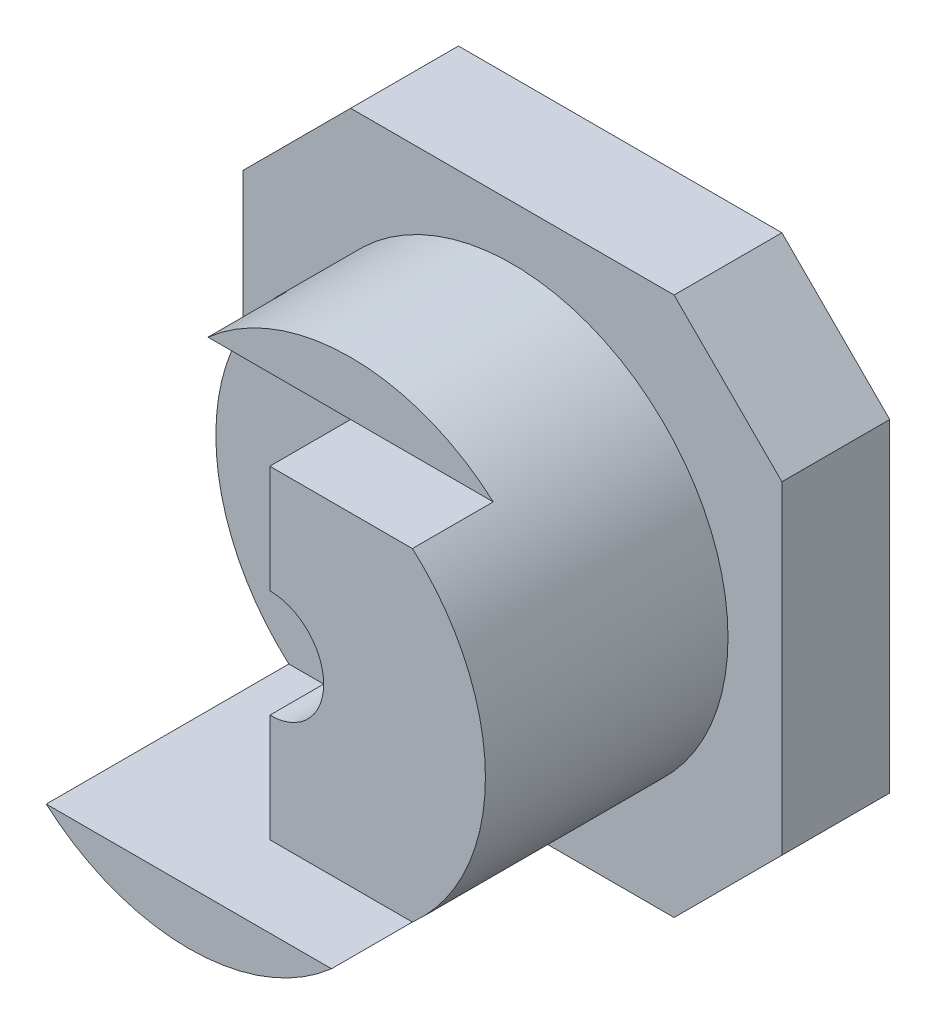
ISO-10303-21;
HEADER;
FILE_DESCRIPTION(('STEP AP214'),'2;1');
FILE_NAME('part.step','',(''),(''),'','','');
FILE_SCHEMA(('AUTOMOTIVE_DESIGN { 1 0 10303 214 1 1 1 1 }'));
ENDSEC;
DATA;
#1=APPLICATION_CONTEXT('core data for automotive mechanical design processes');
#2=APPLICATION_PROTOCOL_DEFINITION('international standard','automotive_design',2000,#1);
#3=PRODUCT_CONTEXT('',#1,'mechanical');
#4=PRODUCT('Part','Part','',(#3));
#5=PRODUCT_RELATED_PRODUCT_CATEGORY('part','',(#4));
#6=PRODUCT_DEFINITION_FORMATION('','',#4);
#7=PRODUCT_DEFINITION_CONTEXT('part definition',#1,'design');
#8=PRODUCT_DEFINITION('design','',#6,#7);
#9=PRODUCT_DEFINITION_SHAPE('','',#8);
#10=(LENGTH_UNIT() NAMED_UNIT(*) SI_UNIT(.MILLI.,.METRE.));
#11=(NAMED_UNIT(*) PLANE_ANGLE_UNIT() SI_UNIT($,.RADIAN.));
#12=(NAMED_UNIT(*) SI_UNIT($,.STERADIAN.) SOLID_ANGLE_UNIT());
#13=UNCERTAINTY_MEASURE_WITH_UNIT(LENGTH_MEASURE(1.E-05),#10,'distance_accuracy_value','');
#14=(GEOMETRIC_REPRESENTATION_CONTEXT(3) GLOBAL_UNCERTAINTY_ASSIGNED_CONTEXT((#13)) GLOBAL_UNIT_ASSIGNED_CONTEXT((#10,
#11,#12)) REPRESENTATION_CONTEXT('',''));
#15=CARTESIAN_POINT('',(0.,0.,0.));
#16=DIRECTION('',(0.,0.,1.));
#17=DIRECTION('',(1.,0.,0.));
#18=AXIS2_PLACEMENT_3D('',#15,#16,#17);
#19=CARTESIAN_POINT('',(0.,0.,2.));
#20=DIRECTION('',(0.,0.,-1.));
#21=DIRECTION('',(-1.,0.,0.));
#22=AXIS2_PLACEMENT_3D('',#19,#20,#21);
#23=PLANE('',#22);
#24=CARTESIAN_POINT('',(0.,0.,2.));
#25=DIRECTION('',(0.,0.,1.));
#26=DIRECTION('',(-1.,0.,0.));
#27=AXIS2_PLACEMENT_3D('',#24,#25,#26);
#28=CIRCLE('',#27,4.);
#29=CARTESIAN_POINT('',(-4.,0.,2.));
#30=VERTEX_POINT('',#29);
#31=EDGE_CURVE('E172',#30,#30,#28,.T.);
#32=ORIENTED_EDGE('',*,*,#31,.F.);
#33=EDGE_LOOP('',(#32));
#34=FACE_BOUND('',#33,.T.);
#35=DIRECTION('',(0.,-1.,0.));
#36=VECTOR('',#35,1.);
#37=CARTESIAN_POINT('',(-5.,-3.,2.));
#38=LINE('',#37,#36);
#39=CARTESIAN_POINT('',(-5.,3.,2.));
#40=VERTEX_POINT('',#39);
#41=CARTESIAN_POINT('',(-5.,-3.,2.));
#42=VERTEX_POINT('',#41);
#43=EDGE_CURVE('E157',#40,#42,#38,.T.);
#44=ORIENTED_EDGE('',*,*,#43,.T.);
#45=DIRECTION('',(0.707106781186548,-0.707106781186548,0.));
#46=VECTOR('',#45,1.);
#47=CARTESIAN_POINT('',(-5.,-3.,2.));
#48=LINE('',#47,#46);
#49=CARTESIAN_POINT('',(-3.,-5.,2.));
#50=VERTEX_POINT('',#49);
#51=EDGE_CURVE('E99',#42,#50,#48,.T.);
#52=ORIENTED_EDGE('',*,*,#51,.T.);
#53=DIRECTION('',(1.,0.,0.));
#54=VECTOR('',#53,1.);
#55=CARTESIAN_POINT('',(-3.,-5.,2.));
#56=LINE('',#55,#54);
#57=CARTESIAN_POINT('',(3.,-5.,2.));
#58=VERTEX_POINT('',#57);
#59=EDGE_CURVE('E253',#50,#58,#56,.T.);
#60=ORIENTED_EDGE('',*,*,#59,.T.);
#61=DIRECTION('',(0.707106781186548,0.707106781186548,0.));
#62=VECTOR('',#61,1.);
#63=CARTESIAN_POINT('',(3.,-5.,2.));
#64=LINE('',#63,#62);
#65=CARTESIAN_POINT('',(5.,-3.,2.));
#66=VERTEX_POINT('',#65);
#67=EDGE_CURVE('E255',#58,#66,#64,.T.);
#68=ORIENTED_EDGE('',*,*,#67,.T.);
#69=DIRECTION('',(0.,1.,0.));
#70=VECTOR('',#69,1.);
#71=CARTESIAN_POINT('',(5.,-3.,2.));
#72=LINE('',#71,#70);
#73=CARTESIAN_POINT('',(5.,3.,2.));
#74=VERTEX_POINT('',#73);
#75=EDGE_CURVE('E120',#66,#74,#72,.T.);
#76=ORIENTED_EDGE('',*,*,#75,.T.);
#77=DIRECTION('',(-0.707106781186548,0.707106781186548,0.));
#78=VECTOR('',#77,1.);
#79=CARTESIAN_POINT('',(3.,5.,2.));
#80=LINE('',#79,#78);
#81=CARTESIAN_POINT('',(3.,5.,2.));
#82=VERTEX_POINT('',#81);
#83=EDGE_CURVE('E114',#74,#82,#80,.T.);
#84=ORIENTED_EDGE('',*,*,#83,.T.);
#85=DIRECTION('',(-1.,0.,0.));
#86=VECTOR('',#85,1.);
#87=CARTESIAN_POINT('',(-3.,5.,2.));
#88=LINE('',#87,#86);
#89=CARTESIAN_POINT('',(-3.,5.,2.));
#90=VERTEX_POINT('',#89);
#91=EDGE_CURVE('E117',#82,#90,#88,.T.);
#92=ORIENTED_EDGE('',*,*,#91,.T.);
#93=DIRECTION('',(-0.707106781186548,-0.707106781186548,0.));
#94=VECTOR('',#93,1.);
#95=CARTESIAN_POINT('',(-5.,3.,2.));
#96=LINE('',#95,#94);
#97=EDGE_CURVE('E57',#90,#40,#96,.T.);
#98=ORIENTED_EDGE('',*,*,#97,.T.);
#99=EDGE_LOOP('',(#44,#52,#60,#68,#76,#84,#92,#98));
#100=FACE_BOUND('',#99,.T.);
#101=ADVANCED_FACE('F33',(#34,#100),#23,.F.);
#102=CARTESIAN_POINT('',(0.,0.,0.));
#103=DIRECTION('',(0.,0.,-1.));
#104=DIRECTION('',(-1.,0.,0.));
#105=AXIS2_PLACEMENT_3D('',#102,#103,#104);
#106=PLANE('',#105);
#107=DIRECTION('',(0.,-1.,0.));
#108=VECTOR('',#107,1.);
#109=CARTESIAN_POINT('',(-5.,-3.,0.));
#110=LINE('',#109,#108);
#111=CARTESIAN_POINT('',(-5.,3.,0.));
#112=VERTEX_POINT('',#111);
#113=CARTESIAN_POINT('',(-5.,-3.,0.));
#114=VERTEX_POINT('',#113);
#115=EDGE_CURVE('E141',#112,#114,#110,.T.);
#116=ORIENTED_EDGE('',*,*,#115,.F.);
#117=DIRECTION('',(-0.707106781186548,-0.707106781186548,0.));
#118=VECTOR('',#117,1.);
#119=CARTESIAN_POINT('',(-5.,3.,0.));
#120=LINE('',#119,#118);
#121=CARTESIAN_POINT('',(-3.,5.,0.));
#122=VERTEX_POINT('',#121);
#123=EDGE_CURVE('E90',#122,#112,#120,.T.);
#124=ORIENTED_EDGE('',*,*,#123,.F.);
#125=DIRECTION('',(-1.,0.,0.));
#126=VECTOR('',#125,1.);
#127=CARTESIAN_POINT('',(-3.,5.,0.));
#128=LINE('',#127,#126);
#129=CARTESIAN_POINT('',(3.,5.,0.));
#130=VERTEX_POINT('',#129);
#131=EDGE_CURVE('E154',#130,#122,#128,.T.);
#132=ORIENTED_EDGE('',*,*,#131,.F.);
#133=DIRECTION('',(-0.707106781186548,0.707106781186548,0.));
#134=VECTOR('',#133,1.);
#135=CARTESIAN_POINT('',(3.,5.,0.));
#136=LINE('',#135,#134);
#137=CARTESIAN_POINT('',(5.,3.,0.));
#138=VERTEX_POINT('',#137);
#139=EDGE_CURVE('E129',#138,#130,#136,.T.);
#140=ORIENTED_EDGE('',*,*,#139,.F.);
#141=DIRECTION('',(0.,1.,0.));
#142=VECTOR('',#141,1.);
#143=CARTESIAN_POINT('',(5.,-3.,0.));
#144=LINE('',#143,#142);
#145=CARTESIAN_POINT('',(5.,-3.,0.));
#146=VERTEX_POINT('',#145);
#147=EDGE_CURVE('E151',#146,#138,#144,.T.);
#148=ORIENTED_EDGE('',*,*,#147,.F.);
#149=DIRECTION('',(0.707106781186548,0.707106781186548,0.));
#150=VECTOR('',#149,1.);
#151=CARTESIAN_POINT('',(3.,-5.,0.));
#152=LINE('',#151,#150);
#153=CARTESIAN_POINT('',(3.,-5.,0.));
#154=VERTEX_POINT('',#153);
#155=EDGE_CURVE('E149',#154,#146,#152,.T.);
#156=ORIENTED_EDGE('',*,*,#155,.F.);
#157=DIRECTION('',(1.,0.,0.));
#158=VECTOR('',#157,1.);
#159=CARTESIAN_POINT('',(-3.,-5.,0.));
#160=LINE('',#159,#158);
#161=CARTESIAN_POINT('',(-3.,-5.,0.));
#162=VERTEX_POINT('',#161);
#163=EDGE_CURVE('E147',#162,#154,#160,.T.);
#164=ORIENTED_EDGE('',*,*,#163,.F.);
#165=DIRECTION('',(0.707106781186548,-0.707106781186548,0.));
#166=VECTOR('',#165,1.);
#167=CARTESIAN_POINT('',(-5.,-3.,0.));
#168=LINE('',#167,#166);
#169=EDGE_CURVE('E144',#114,#162,#168,.T.);
#170=ORIENTED_EDGE('',*,*,#169,.F.);
#171=EDGE_LOOP('',(#116,#124,#132,#140,#148,#156,#164,#170));
#172=FACE_BOUND('',#171,.T.);
#173=CARTESIAN_POINT('',(0.,0.,0.));
#174=DIRECTION('',(0.,0.,1.));
#175=DIRECTION('',(1.,0.,0.));
#176=AXIS2_PLACEMENT_3D('',#173,#174,#175);
#177=CIRCLE('',#176,1.);
#178=CARTESIAN_POINT('',(0.999999999999998,0.,0.));
#179=VERTEX_POINT('',#178);
#180=EDGE_CURVE('E145',#179,#179,#177,.T.);
#181=ORIENTED_EDGE('',*,*,#180,.T.);
#182=EDGE_LOOP('',(#181));
#183=FACE_BOUND('',#182,.T.);
#184=ADVANCED_FACE('F268',(#172,#183),#106,.T.);
#185=CARTESIAN_POINT('',(-5.,-3.,2.));
#186=DIRECTION('',(1.,0.,0.));
#187=DIRECTION('',(0.,0.,-1.));
#188=AXIS2_PLACEMENT_3D('',#185,#186,#187);
#189=PLANE('',#188);
#190=ORIENTED_EDGE('',*,*,#115,.T.);
#191=DIRECTION('',(0.,0.,-1.));
#192=VECTOR('',#191,1.);
#193=CARTESIAN_POINT('',(-5.,-3.,2.));
#194=LINE('',#193,#192);
#195=EDGE_CURVE('E170',#42,#114,#194,.T.);
#196=ORIENTED_EDGE('',*,*,#195,.F.);
#197=ORIENTED_EDGE('',*,*,#43,.F.);
#198=DIRECTION('',(0.,0.,-1.));
#199=VECTOR('',#198,1.);
#200=CARTESIAN_POINT('',(-5.,3.,2.));
#201=LINE('',#200,#199);
#202=EDGE_CURVE('E137',#40,#112,#201,.T.);
#203=ORIENTED_EDGE('',*,*,#202,.T.);
#204=EDGE_LOOP('',(#190,#196,#197,#203));
#205=FACE_BOUND('',#204,.T.);
#206=ADVANCED_FACE('F35',(#205),#189,.F.);
#207=CARTESIAN_POINT('',(-5.,-3.,2.));
#208=DIRECTION('',(0.707106781186547,0.707106781186547,0.));
#209=DIRECTION('',(-0.707106781186548,0.707106781186548,0.));
#210=AXIS2_PLACEMENT_3D('',#207,#208,#209);
#211=PLANE('',#210);
#212=ORIENTED_EDGE('',*,*,#169,.T.);
#213=DIRECTION('',(0.,0.,-1.));
#214=VECTOR('',#213,1.);
#215=CARTESIAN_POINT('',(-3.,-5.,2.));
#216=LINE('',#215,#214);
#217=EDGE_CURVE('E167',#50,#162,#216,.T.);
#218=ORIENTED_EDGE('',*,*,#217,.F.);
#219=ORIENTED_EDGE('',*,*,#51,.F.);
#220=ORIENTED_EDGE('',*,*,#195,.T.);
#221=EDGE_LOOP('',(#212,#218,#219,#220));
#222=FACE_BOUND('',#221,.T.);
#223=ADVANCED_FACE('F274',(#222),#211,.F.);
#224=CARTESIAN_POINT('',(-3.,-5.,2.));
#225=DIRECTION('',(0.,1.,0.));
#226=DIRECTION('',(0.,0.,1.));
#227=AXIS2_PLACEMENT_3D('',#224,#225,#226);
#228=PLANE('',#227);
#229=ORIENTED_EDGE('',*,*,#163,.T.);
#230=DIRECTION('',(0.,0.,-1.));
#231=VECTOR('',#230,1.);
#232=CARTESIAN_POINT('',(3.,-5.,2.));
#233=LINE('',#232,#231);
#234=EDGE_CURVE('E164',#58,#154,#233,.T.);
#235=ORIENTED_EDGE('',*,*,#234,.F.);
#236=ORIENTED_EDGE('',*,*,#59,.F.);
#237=ORIENTED_EDGE('',*,*,#217,.T.);
#238=EDGE_LOOP('',(#229,#235,#236,#237));
#239=FACE_BOUND('',#238,.T.);
#240=ADVANCED_FACE('F277',(#239),#228,.F.);
#241=CARTESIAN_POINT('',(3.,-5.,2.));
#242=DIRECTION('',(-0.707106781186547,0.707106781186547,0.));
#243=DIRECTION('',(-0.707106781186548,-0.707106781186548,0.));
#244=AXIS2_PLACEMENT_3D('',#241,#242,#243);
#245=PLANE('',#244);
#246=ORIENTED_EDGE('',*,*,#155,.T.);
#247=DIRECTION('',(0.,0.,-1.));
#248=VECTOR('',#247,1.);
#249=CARTESIAN_POINT('',(5.,-3.,2.));
#250=LINE('',#249,#248);
#251=EDGE_CURVE('E161',#66,#146,#250,.T.);
#252=ORIENTED_EDGE('',*,*,#251,.F.);
#253=ORIENTED_EDGE('',*,*,#67,.F.);
#254=ORIENTED_EDGE('',*,*,#234,.T.);
#255=EDGE_LOOP('',(#246,#252,#253,#254));
#256=FACE_BOUND('',#255,.T.);
#257=ADVANCED_FACE('F261',(#256),#245,.F.);
#258=CARTESIAN_POINT('',(5.,-3.,2.));
#259=DIRECTION('',(-1.,0.,0.));
#260=DIRECTION('',(0.,0.,1.));
#261=AXIS2_PLACEMENT_3D('',#258,#259,#260);
#262=PLANE('',#261);
#263=ORIENTED_EDGE('',*,*,#147,.T.);
#264=DIRECTION('',(0.,0.,-1.));
#265=VECTOR('',#264,1.);
#266=CARTESIAN_POINT('',(5.,3.,2.));
#267=LINE('',#266,#265);
#268=EDGE_CURVE('E132',#74,#138,#267,.T.);
#269=ORIENTED_EDGE('',*,*,#268,.F.);
#270=ORIENTED_EDGE('',*,*,#75,.F.);
#271=ORIENTED_EDGE('',*,*,#251,.T.);
#272=EDGE_LOOP('',(#263,#269,#270,#271));
#273=FACE_BOUND('',#272,.T.);
#274=ADVANCED_FACE('F265',(#273),#262,.F.);
#275=CARTESIAN_POINT('',(3.,5.,2.));
#276=DIRECTION('',(-0.707106781186547,-0.707106781186547,0.));
#277=DIRECTION('',(0.707106781186548,-0.707106781186548,0.));
#278=AXIS2_PLACEMENT_3D('',#275,#276,#277);
#279=PLANE('',#278);
#280=ORIENTED_EDGE('',*,*,#139,.T.);
#281=DIRECTION('',(0.,0.,-1.));
#282=VECTOR('',#281,1.);
#283=CARTESIAN_POINT('',(3.,5.,2.));
#284=LINE('',#283,#282);
#285=EDGE_CURVE('E126',#82,#130,#284,.T.);
#286=ORIENTED_EDGE('',*,*,#285,.F.);
#287=ORIENTED_EDGE('',*,*,#83,.F.);
#288=ORIENTED_EDGE('',*,*,#268,.T.);
#289=EDGE_LOOP('',(#280,#286,#287,#288));
#290=FACE_BOUND('',#289,.T.);
#291=ADVANCED_FACE('F127',(#290),#279,.F.);
#292=CARTESIAN_POINT('',(-3.,5.,2.));
#293=DIRECTION('',(0.,-1.,0.));
#294=DIRECTION('',(0.,0.,-1.));
#295=AXIS2_PLACEMENT_3D('',#292,#293,#294);
#296=PLANE('',#295);
#297=ORIENTED_EDGE('',*,*,#131,.T.);
#298=DIRECTION('',(0.,0.,-1.));
#299=VECTOR('',#298,1.);
#300=CARTESIAN_POINT('',(-3.,5.,2.));
#301=LINE('',#300,#299);
#302=EDGE_CURVE('E133',#90,#122,#301,.T.);
#303=ORIENTED_EDGE('',*,*,#302,.F.);
#304=ORIENTED_EDGE('',*,*,#91,.F.);
#305=ORIENTED_EDGE('',*,*,#285,.T.);
#306=EDGE_LOOP('',(#297,#303,#304,#305));
#307=FACE_BOUND('',#306,.T.);
#308=ADVANCED_FACE('F135',(#307),#296,.F.);
#309=CARTESIAN_POINT('',(-5.,3.,2.));
#310=DIRECTION('',(0.707106781186547,-0.707106781186547,0.));
#311=DIRECTION('',(0.707106781186548,0.707106781186548,0.));
#312=AXIS2_PLACEMENT_3D('',#309,#310,#311);
#313=PLANE('',#312);
#314=ORIENTED_EDGE('',*,*,#123,.T.);
#315=ORIENTED_EDGE('',*,*,#202,.F.);
#316=ORIENTED_EDGE('',*,*,#97,.F.);
#317=ORIENTED_EDGE('',*,*,#302,.T.);
#318=EDGE_LOOP('',(#314,#315,#316,#317));
#319=FACE_BOUND('',#318,.T.);
#320=ADVANCED_FACE('F270',(#319),#313,.F.);
#321=CARTESIAN_POINT('',(0.,0.,2.));
#322=DIRECTION('',(0.,0.,-1.));
#323=DIRECTION('',(-1.,0.,0.));
#324=AXIS2_PLACEMENT_3D('',#321,#322,#323);
#325=CYLINDRICAL_SURFACE('',#324,1.);
#326=DIRECTION('',(0.,0.,-1.));
#327=VECTOR('',#326,1.);
#328=CARTESIAN_POINT('',(0.,-0.999999999999999,2.));
#329=LINE('',#328,#327);
#330=CARTESIAN_POINT('',(0.,-0.999999999999999,6.5));
#331=VERTEX_POINT('',#330);
#332=CARTESIAN_POINT('',(0.,-0.999999999999999,3.5));
#333=VERTEX_POINT('',#332);
#334=EDGE_CURVE('E225',#331,#333,#329,.T.);
#335=ORIENTED_EDGE('',*,*,#334,.F.);
#336=CARTESIAN_POINT('',(0.,0.,6.5));
#337=DIRECTION('',(0.,0.,-1.));
#338=DIRECTION('',(-1.,0.,0.));
#339=AXIS2_PLACEMENT_3D('',#336,#337,#338);
#340=CIRCLE('',#339,1.);
#341=CARTESIAN_POINT('',(0.,1.,6.5));
#342=VERTEX_POINT('',#341);
#343=EDGE_CURVE('E235',#342,#331,#340,.T.);
#344=ORIENTED_EDGE('',*,*,#343,.F.);
#345=DIRECTION('',(0.,0.,-1.));
#346=VECTOR('',#345,1.);
#347=CARTESIAN_POINT('',(0.,1.,2.));
#348=LINE('',#347,#346);
#349=CARTESIAN_POINT('',(0.,1.,3.5));
#350=VERTEX_POINT('',#349);
#351=EDGE_CURVE('E217',#350,#342,#348,.F.);
#352=ORIENTED_EDGE('',*,*,#351,.F.);
#353=CARTESIAN_POINT('',(0.,0.,3.5));
#354=DIRECTION('',(0.,0.,-1.));
#355=DIRECTION('',(0.,1.,0.));
#356=AXIS2_PLACEMENT_3D('',#353,#354,#355);
#357=CIRCLE('',#356,1.);
#358=EDGE_CURVE('E230',#333,#350,#357,.T.);
#359=ORIENTED_EDGE('',*,*,#358,.F.);
#360=EDGE_LOOP('',(#335,#344,#352,#359));
#361=FACE_BOUND('',#360,.T.);
#362=ORIENTED_EDGE('',*,*,#180,.F.);
#363=EDGE_LOOP('',(#362));
#364=FACE_BOUND('',#363,.T.);
#365=ADVANCED_FACE('F294',(#361,#364),#325,.F.);
#366=CARTESIAN_POINT('',(0.,0.,8.));
#367=DIRECTION('',(0.,0.,-1.));
#368=DIRECTION('',(-1.,0.,0.));
#369=AXIS2_PLACEMENT_3D('',#366,#367,#368);
#370=PLANE('',#369);
#371=CARTESIAN_POINT('',(0.,0.,8.));
#372=DIRECTION('',(0.,0.,1.));
#373=DIRECTION('',(-1.,0.,0.));
#374=AXIS2_PLACEMENT_3D('',#371,#372,#373);
#375=CIRCLE('',#374,4.);
#376=CARTESIAN_POINT('',(-2.64575131106459,-3.,8.));
#377=VERTEX_POINT('',#376);
#378=CARTESIAN_POINT('',(2.64575131106459,-3.,8.));
#379=VERTEX_POINT('',#378);
#380=EDGE_CURVE('E194',#377,#379,#375,.T.);
#381=ORIENTED_EDGE('',*,*,#380,.T.);
#382=DIRECTION('',(1.,0.,0.));
#383=VECTOR('',#382,1.);
#384=CARTESIAN_POINT('',(-8.,-3.,8.));
#385=LINE('',#384,#383);
#386=EDGE_CURVE('E48',#377,#379,#385,.T.);
#387=ORIENTED_EDGE('',*,*,#386,.F.);
#388=EDGE_LOOP('',(#381,#387));
#389=FACE_BOUND('',#388,.T.);
#390=ADVANCED_FACE('F326',(#389),#370,.F.);
#391=CARTESIAN_POINT('',(0.,0.,8.));
#392=DIRECTION('',(0.,0.,-1.));
#393=DIRECTION('',(-1.,0.,0.));
#394=AXIS2_PLACEMENT_3D('',#391,#392,#393);
#395=CYLINDRICAL_SURFACE('',#394,4.);
#396=CARTESIAN_POINT('',(0.,0.,3.5));
#397=DIRECTION('',(0.,0.,-1.));
#398=DIRECTION('',(0.,1.,0.));
#399=AXIS2_PLACEMENT_3D('',#396,#397,#398);
#400=CIRCLE('',#399,4.);
#401=CARTESIAN_POINT('',(-2.64575131106459,-3.,3.5));
#402=VERTEX_POINT('',#401);
#403=CARTESIAN_POINT('',(-2.64575131106459,3.,3.5));
#404=VERTEX_POINT('',#403);
#405=EDGE_CURVE('E11',#402,#404,#400,.T.);
#406=ORIENTED_EDGE('',*,*,#405,.T.);
#407=DIRECTION('',(0.,0.,-1.));
#408=VECTOR('',#407,1.);
#409=CARTESIAN_POINT('',(-2.64575131106459,3.,8.));
#410=LINE('',#409,#408);
#411=CARTESIAN_POINT('',(-2.64575131106459,3.,5.));
#412=VERTEX_POINT('',#411);
#413=EDGE_CURVE('E228',#404,#412,#410,.F.);
#414=ORIENTED_EDGE('',*,*,#413,.T.);
#415=CARTESIAN_POINT('',(0.,0.,5.));
#416=DIRECTION('',(0.,0.,-1.));
#417=DIRECTION('',(-1.,0.,0.));
#418=AXIS2_PLACEMENT_3D('',#415,#416,#417);
#419=CIRCLE('',#418,4.);
#420=CARTESIAN_POINT('',(2.64575131106459,3.,5.));
#421=VERTEX_POINT('',#420);
#422=EDGE_CURVE('E181',#412,#421,#419,.T.);
#423=ORIENTED_EDGE('',*,*,#422,.T.);
#424=DIRECTION('',(0.,0.,-1.));
#425=VECTOR('',#424,1.);
#426=CARTESIAN_POINT('',(2.64575131106459,3.,8.));
#427=LINE('',#426,#425);
#428=CARTESIAN_POINT('',(2.64575131106459,3.,6.5));
#429=VERTEX_POINT('',#428);
#430=EDGE_CURVE('E178',#421,#429,#427,.F.);
#431=ORIENTED_EDGE('',*,*,#430,.T.);
#432=CARTESIAN_POINT('',(0.,0.,6.5));
#433=DIRECTION('',(0.,0.,-1.));
#434=DIRECTION('',(-1.,0.,0.));
#435=AXIS2_PLACEMENT_3D('',#432,#433,#434);
#436=CIRCLE('',#435,4.);
#437=CARTESIAN_POINT('',(2.64575131106459,-3.,6.5));
#438=VERTEX_POINT('',#437);
#439=EDGE_CURVE('E175',#429,#438,#436,.T.);
#440=ORIENTED_EDGE('',*,*,#439,.T.);
#441=DIRECTION('',(0.,0.,-1.));
#442=VECTOR('',#441,1.);
#443=CARTESIAN_POINT('',(2.64575131106459,-3.,8.));
#444=LINE('',#443,#442);
#445=EDGE_CURVE('E173',#438,#379,#444,.F.);
#446=ORIENTED_EDGE('',*,*,#445,.T.);
#447=ORIENTED_EDGE('',*,*,#380,.F.);
#448=DIRECTION('',(0.,0.,-1.));
#449=VECTOR('',#448,1.);
#450=CARTESIAN_POINT('',(-2.64575131106459,-3.,8.));
#451=LINE('',#450,#449);
#452=EDGE_CURVE('E41',#377,#402,#451,.T.);
#453=ORIENTED_EDGE('',*,*,#452,.T.);
#454=EDGE_LOOP('',(#406,#414,#423,#431,#440,#446,#447,#453));
#455=FACE_BOUND('',#454,.T.);
#456=ORIENTED_EDGE('',*,*,#31,.T.);
#457=EDGE_LOOP('',(#456));
#458=FACE_BOUND('',#457,.T.);
#459=ADVANCED_FACE('F188',(#455,#458),#395,.T.);
#460=CARTESIAN_POINT('',(-8.,3.,5.));
#461=DIRECTION('',(0.,0.,-1.));
#462=DIRECTION('',(-1.,0.,0.));
#463=AXIS2_PLACEMENT_3D('',#460,#461,#462);
#464=PLANE('',#463);
#465=DIRECTION('',(1.,0.,0.));
#466=VECTOR('',#465,1.);
#467=CARTESIAN_POINT('',(-8.,3.,5.));
#468=LINE('',#467,#466);
#469=CARTESIAN_POINT('',(0.,3.,5.));
#470=VERTEX_POINT('',#469);
#471=EDGE_CURVE('E232',#412,#470,#468,.T.);
#472=ORIENTED_EDGE('',*,*,#471,.T.);
#473=EDGE_CURVE('E236',#470,#421,#468,.T.);
#474=ORIENTED_EDGE('',*,*,#473,.T.);
#475=ORIENTED_EDGE('',*,*,#422,.F.);
#476=EDGE_LOOP('',(#472,#474,#475));
#477=FACE_BOUND('',#476,.T.);
#478=ADVANCED_FACE('F340',(#477),#464,.F.);
#479=CARTESIAN_POINT('',(-8.,3.,6.5));
#480=DIRECTION('',(0.,-1.,0.));
#481=DIRECTION('',(0.,0.,-1.));
#482=AXIS2_PLACEMENT_3D('',#479,#480,#481);
#483=PLANE('',#482);
#484=ORIENTED_EDGE('',*,*,#473,.F.);
#485=DIRECTION('',(0.,0.,1.));
#486=VECTOR('',#485,1.);
#487=CARTESIAN_POINT('',(0.,3.,6.5));
#488=LINE('',#487,#486);
#489=CARTESIAN_POINT('',(0.,3.,6.5));
#490=VERTEX_POINT('',#489);
#491=EDGE_CURVE('E220',#470,#490,#488,.T.);
#492=ORIENTED_EDGE('',*,*,#491,.T.);
#493=DIRECTION('',(1.,0.,0.));
#494=VECTOR('',#493,1.);
#495=CARTESIAN_POINT('',(-8.,3.,6.5));
#496=LINE('',#495,#494);
#497=EDGE_CURVE('E237',#490,#429,#496,.T.);
#498=ORIENTED_EDGE('',*,*,#497,.T.);
#499=ORIENTED_EDGE('',*,*,#430,.F.);
#500=EDGE_LOOP('',(#484,#492,#498,#499));
#501=FACE_BOUND('',#500,.T.);
#502=ADVANCED_FACE('F346',(#501),#483,.F.);
#503=CARTESIAN_POINT('',(-8.,-3.,6.5));
#504=DIRECTION('',(0.,0.,-1.));
#505=DIRECTION('',(-1.,0.,0.));
#506=AXIS2_PLACEMENT_3D('',#503,#504,#505);
#507=PLANE('',#506);
#508=ORIENTED_EDGE('',*,*,#497,.F.);
#509=DIRECTION('',(0.,-1.,0.));
#510=VECTOR('',#509,1.);
#511=CARTESIAN_POINT('',(0.,3.,6.5));
#512=LINE('',#511,#510);
#513=EDGE_CURVE('E474',#490,#342,#512,.T.);
#514=ORIENTED_EDGE('',*,*,#513,.T.);
#515=ORIENTED_EDGE('',*,*,#343,.T.);
#516=CARTESIAN_POINT('',(0.,-3.,6.5));
#517=VERTEX_POINT('',#516);
#518=EDGE_CURVE('E486',#331,#517,#512,.T.);
#519=ORIENTED_EDGE('',*,*,#518,.T.);
#520=DIRECTION('',(1.,0.,0.));
#521=VECTOR('',#520,1.);
#522=CARTESIAN_POINT('',(-8.,-3.,6.5));
#523=LINE('',#522,#521);
#524=EDGE_CURVE('E240',#517,#438,#523,.T.);
#525=ORIENTED_EDGE('',*,*,#524,.T.);
#526=ORIENTED_EDGE('',*,*,#439,.F.);
#527=EDGE_LOOP('',(#508,#514,#515,#519,#525,#526));
#528=FACE_BOUND('',#527,.T.);
#529=ADVANCED_FACE('F354',(#528),#507,.F.);
#530=CARTESIAN_POINT('',(-8.,-3.,8.));
#531=DIRECTION('',(0.,-1.,0.));
#532=DIRECTION('',(0.,0.,-1.));
#533=AXIS2_PLACEMENT_3D('',#530,#531,#532);
#534=PLANE('',#533);
#535=ORIENTED_EDGE('',*,*,#386,.T.);
#536=ORIENTED_EDGE('',*,*,#445,.F.);
#537=ORIENTED_EDGE('',*,*,#524,.F.);
#538=DIRECTION('',(0.,0.,-1.));
#539=VECTOR('',#538,1.);
#540=CARTESIAN_POINT('',(0.,-3.,6.5));
#541=LINE('',#540,#539);
#542=CARTESIAN_POINT('',(0.,-3.,3.5));
#543=VERTEX_POINT('',#542);
#544=EDGE_CURVE('E214',#517,#543,#541,.T.);
#545=ORIENTED_EDGE('',*,*,#544,.T.);
#546=DIRECTION('',(1.,0.,0.));
#547=VECTOR('',#546,1.);
#548=CARTESIAN_POINT('',(-16.,-3.,3.5));
#549=LINE('',#548,#547);
#550=EDGE_CURVE('E205',#402,#543,#549,.T.);
#551=ORIENTED_EDGE('',*,*,#550,.F.);
#552=ORIENTED_EDGE('',*,*,#452,.F.);
#553=EDGE_LOOP('',(#535,#536,#537,#545,#551,#552));
#554=FACE_BOUND('',#553,.T.);
#555=ADVANCED_FACE('F211',(#554),#534,.F.);
#556=CARTESIAN_POINT('',(-16.,3.,3.5));
#557=DIRECTION('',(0.,0.,-1.));
#558=DIRECTION('',(0.,1.,0.));
#559=AXIS2_PLACEMENT_3D('',#556,#557,#558);
#560=PLANE('',#559);
#561=ORIENTED_EDGE('',*,*,#358,.T.);
#562=DIRECTION('',(0.,1.,0.));
#563=VECTOR('',#562,1.);
#564=CARTESIAN_POINT('',(0.,3.,3.5));
#565=LINE('',#564,#563);
#566=CARTESIAN_POINT('',(0.,3.,3.5));
#567=VERTEX_POINT('',#566);
#568=EDGE_CURVE('E478',#350,#567,#565,.T.);
#569=ORIENTED_EDGE('',*,*,#568,.T.);
#570=DIRECTION('',(1.,0.,0.));
#571=VECTOR('',#570,1.);
#572=CARTESIAN_POINT('',(-16.,3.,3.5));
#573=LINE('',#572,#571);
#574=EDGE_CURVE('E209',#404,#567,#573,.T.);
#575=ORIENTED_EDGE('',*,*,#574,.F.);
#576=ORIENTED_EDGE('',*,*,#405,.F.);
#577=ORIENTED_EDGE('',*,*,#550,.T.);
#578=EDGE_CURVE('E493',#543,#333,#565,.T.);
#579=ORIENTED_EDGE('',*,*,#578,.T.);
#580=EDGE_LOOP('',(#561,#569,#575,#576,#577,#579));
#581=FACE_BOUND('',#580,.T.);
#582=ADVANCED_FACE('F202',(#581),#560,.F.);
#583=CARTESIAN_POINT('',(-16.,3.,6.5));
#584=DIRECTION('',(0.,1.,0.));
#585=DIRECTION('',(0.,0.,1.));
#586=AXIS2_PLACEMENT_3D('',#583,#584,#585);
#587=PLANE('',#586);
#588=ORIENTED_EDGE('',*,*,#574,.T.);
#589=EDGE_CURVE('E215',#567,#470,#488,.T.);
#590=ORIENTED_EDGE('',*,*,#589,.T.);
#591=ORIENTED_EDGE('',*,*,#471,.F.);
#592=ORIENTED_EDGE('',*,*,#413,.F.);
#593=EDGE_LOOP('',(#588,#590,#591,#592));
#594=FACE_BOUND('',#593,.T.);
#595=ADVANCED_FACE('F375',(#594),#587,.F.);
#596=CARTESIAN_POINT('',(0.,0.,0.));
#597=DIRECTION('',(1.,0.,0.));
#598=DIRECTION('',(0.,0.,-1.));
#599=AXIS2_PLACEMENT_3D('',#596,#597,#598);
#600=PLANE('',#599);
#601=ORIENTED_EDGE('',*,*,#334,.T.);
#602=ORIENTED_EDGE('',*,*,#578,.F.);
#603=ORIENTED_EDGE('',*,*,#544,.F.);
#604=ORIENTED_EDGE('',*,*,#518,.F.);
#605=EDGE_LOOP('',(#601,#602,#603,#604));
#606=FACE_BOUND('',#605,.T.);
#607=ADVANCED_FACE('F382',(#606),#600,.F.);
#608=ORIENTED_EDGE('',*,*,#351,.T.);
#609=ORIENTED_EDGE('',*,*,#513,.F.);
#610=ORIENTED_EDGE('',*,*,#491,.F.);
#611=ORIENTED_EDGE('',*,*,#589,.F.);
#612=ORIENTED_EDGE('',*,*,#568,.F.);
#613=EDGE_LOOP('',(#608,#609,#610,#611,#612));
#614=FACE_BOUND('',#613,.T.);
#615=ADVANCED_FACE('F390',(#614),#600,.F.);
#616=CLOSED_SHELL('',(#101,#184,#206,#223,#240,#257,#274,#291,#308,#320,#365,#390,#459,#478,
#502,#529,#555,#582,#595,#607,#615));
#617=MANIFOLD_SOLID_BREP('B2',#616);
#618=ADVANCED_BREP_SHAPE_REPRESENTATION('',(#18,#617),#14);
#619=SHAPE_DEFINITION_REPRESENTATION(#9,#618);
ENDSEC;
END-ISO-10303-21;
